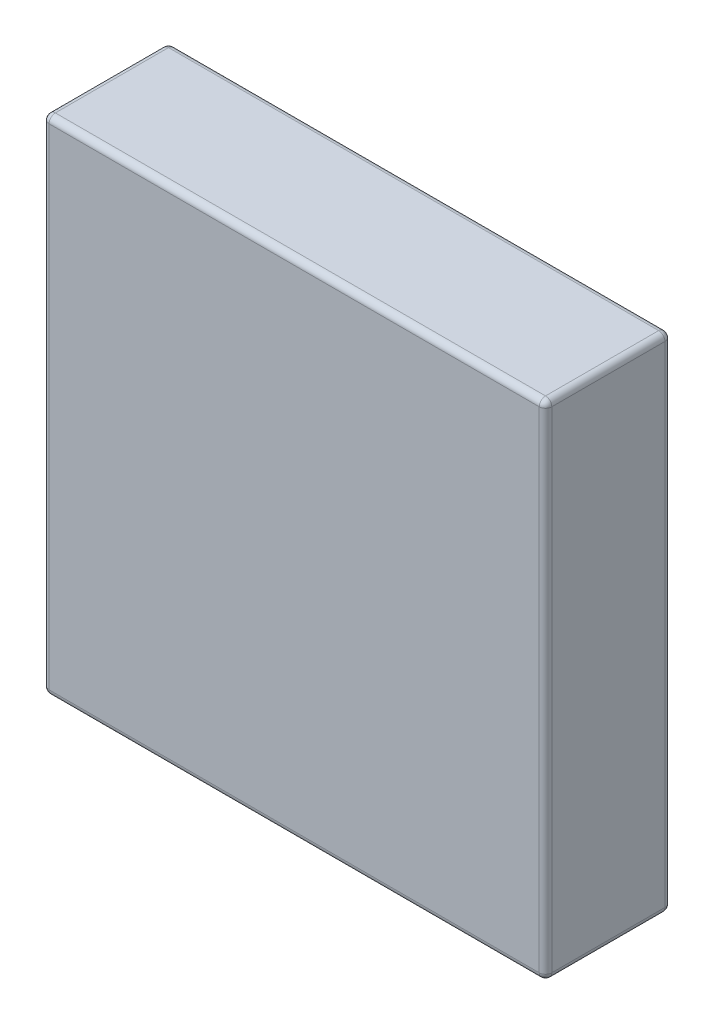
ISO-10303-21;
HEADER;
FILE_DESCRIPTION(('STEP AP214'),'2;1');
FILE_NAME('part.step','',(''),(''),'','','');
FILE_SCHEMA(('AUTOMOTIVE_DESIGN { 1 0 10303 214 1 1 1 1 }'));
ENDSEC;
DATA;
#1=APPLICATION_CONTEXT('core data for automotive mechanical design processes');
#2=APPLICATION_PROTOCOL_DEFINITION('international standard','automotive_design',2000,#1);
#3=PRODUCT_CONTEXT('',#1,'mechanical');
#4=PRODUCT('Part','Part','',(#3));
#5=PRODUCT_RELATED_PRODUCT_CATEGORY('part','',(#4));
#6=PRODUCT_DEFINITION_FORMATION('','',#4);
#7=PRODUCT_DEFINITION_CONTEXT('part definition',#1,'design');
#8=PRODUCT_DEFINITION('design','',#6,#7);
#9=PRODUCT_DEFINITION_SHAPE('','',#8);
#10=(LENGTH_UNIT() NAMED_UNIT(*) SI_UNIT(.MILLI.,.METRE.));
#11=(NAMED_UNIT(*) PLANE_ANGLE_UNIT() SI_UNIT($,.RADIAN.));
#12=(NAMED_UNIT(*) SI_UNIT($,.STERADIAN.) SOLID_ANGLE_UNIT());
#13=UNCERTAINTY_MEASURE_WITH_UNIT(LENGTH_MEASURE(1.E-05),#10,'distance_accuracy_value','');
#14=(GEOMETRIC_REPRESENTATION_CONTEXT(3) GLOBAL_UNCERTAINTY_ASSIGNED_CONTEXT((#13)) GLOBAL_UNIT_ASSIGNED_CONTEXT((#10,
#11,#12)) REPRESENTATION_CONTEXT('',''));
#15=CARTESIAN_POINT('',(0.,0.,0.));
#16=DIRECTION('',(0.,0.,1.));
#17=DIRECTION('',(1.,0.,0.));
#18=AXIS2_PLACEMENT_3D('',#15,#16,#17);
#19=CARTESIAN_POINT('',(0.,0.,10.));
#20=DIRECTION('',(1.,0.,0.));
#21=DIRECTION('',(0.,0.,-1.));
#22=AXIS2_PLACEMENT_3D('',#19,#20,#21);
#23=PLANE('',#22);
#24=DIRECTION('',(0.,-1.,0.));
#25=VECTOR('',#24,1.);
#26=CARTESIAN_POINT('',(0.,0.,0.5));
#27=LINE('',#26,#25);
#28=CARTESIAN_POINT('',(0.,39.5,0.5));
#29=VERTEX_POINT('',#28);
#30=CARTESIAN_POINT('',(0.,0.5,0.5));
#31=VERTEX_POINT('',#30);
#32=EDGE_CURVE('E277',#29,#31,#27,.T.);
#33=ORIENTED_EDGE('',*,*,#32,.T.);
#34=DIRECTION('',(0.,0.,-1.));
#35=VECTOR('',#34,1.);
#36=CARTESIAN_POINT('',(0.,0.5,10.));
#37=LINE('',#36,#35);
#38=CARTESIAN_POINT('',(0.,0.5,9.5));
#39=VERTEX_POINT('',#38);
#40=EDGE_CURVE('E221',#31,#39,#37,.F.);
#41=ORIENTED_EDGE('',*,*,#40,.T.);
#42=DIRECTION('',(0.,-1.,0.));
#43=VECTOR('',#42,1.);
#44=CARTESIAN_POINT('',(0.,0.,9.5));
#45=LINE('',#44,#43);
#46=CARTESIAN_POINT('',(0.,39.5,9.5));
#47=VERTEX_POINT('',#46);
#48=EDGE_CURVE('E226',#39,#47,#45,.F.);
#49=ORIENTED_EDGE('',*,*,#48,.T.);
#50=DIRECTION('',(0.,0.,-1.));
#51=VECTOR('',#50,1.);
#52=CARTESIAN_POINT('',(0.,39.5,10.));
#53=LINE('',#52,#51);
#54=EDGE_CURVE('E309',#47,#29,#53,.T.);
#55=ORIENTED_EDGE('',*,*,#54,.T.);
#56=EDGE_LOOP('',(#33,#41,#49,#55));
#57=FACE_BOUND('',#56,.T.);
#58=ADVANCED_FACE('F35',(#57),#23,.F.);
#59=CARTESIAN_POINT('',(0.,0.,10.));
#60=DIRECTION('',(0.,1.,0.));
#61=DIRECTION('',(0.,0.,1.));
#62=AXIS2_PLACEMENT_3D('',#59,#60,#61);
#63=PLANE('',#62);
#64=DIRECTION('',(1.,0.,0.));
#65=VECTOR('',#64,1.);
#66=CARTESIAN_POINT('',(0.,0.,9.5));
#67=LINE('',#66,#65);
#68=CARTESIAN_POINT('',(39.5,0.,9.5));
#69=VERTEX_POINT('',#68);
#70=CARTESIAN_POINT('',(0.5,0.,9.5));
#71=VERTEX_POINT('',#70);
#72=EDGE_CURVE('E133',#69,#71,#67,.F.);
#73=ORIENTED_EDGE('',*,*,#72,.T.);
#74=DIRECTION('',(0.,0.,-1.));
#75=VECTOR('',#74,1.);
#76=CARTESIAN_POINT('',(0.5,0.,10.));
#77=LINE('',#76,#75);
#78=CARTESIAN_POINT('',(0.5,0.,0.5));
#79=VERTEX_POINT('',#78);
#80=EDGE_CURVE('E129',#71,#79,#77,.T.);
#81=ORIENTED_EDGE('',*,*,#80,.T.);
#82=DIRECTION('',(1.,0.,0.));
#83=VECTOR('',#82,1.);
#84=CARTESIAN_POINT('',(40.,0.,0.5));
#85=LINE('',#84,#83);
#86=CARTESIAN_POINT('',(39.5,0.,0.5));
#87=VERTEX_POINT('',#86);
#88=EDGE_CURVE('E123',#79,#87,#85,.T.);
#89=ORIENTED_EDGE('',*,*,#88,.T.);
#90=DIRECTION('',(0.,0.,-1.));
#91=VECTOR('',#90,1.);
#92=CARTESIAN_POINT('',(39.5,0.,10.));
#93=LINE('',#92,#91);
#94=EDGE_CURVE('E126',#87,#69,#93,.F.);
#95=ORIENTED_EDGE('',*,*,#94,.T.);
#96=EDGE_LOOP('',(#73,#81,#89,#95));
#97=FACE_BOUND('',#96,.T.);
#98=ADVANCED_FACE('F125',(#97),#63,.F.);
#99=CARTESIAN_POINT('',(40.,0.,10.));
#100=DIRECTION('',(-1.,0.,0.));
#101=DIRECTION('',(0.,0.,1.));
#102=AXIS2_PLACEMENT_3D('',#99,#100,#101);
#103=PLANE('',#102);
#104=DIRECTION('',(0.,1.,0.));
#105=VECTOR('',#104,1.);
#106=CARTESIAN_POINT('',(40.,0.,9.5));
#107=LINE('',#106,#105);
#108=CARTESIAN_POINT('',(40.,39.5,9.5));
#109=VERTEX_POINT('',#108);
#110=CARTESIAN_POINT('',(40.,0.5,9.5));
#111=VERTEX_POINT('',#110);
#112=EDGE_CURVE('E245',#109,#111,#107,.F.);
#113=ORIENTED_EDGE('',*,*,#112,.T.);
#114=DIRECTION('',(0.,0.,-1.));
#115=VECTOR('',#114,1.);
#116=CARTESIAN_POINT('',(40.,0.5,10.));
#117=LINE('',#116,#115);
#118=CARTESIAN_POINT('',(40.,0.5,0.5));
#119=VERTEX_POINT('',#118);
#120=EDGE_CURVE('E247',#111,#119,#117,.T.);
#121=ORIENTED_EDGE('',*,*,#120,.T.);
#122=DIRECTION('',(0.,1.,0.));
#123=VECTOR('',#122,1.);
#124=CARTESIAN_POINT('',(40.,40.,0.5));
#125=LINE('',#124,#123);
#126=CARTESIAN_POINT('',(40.,39.5,0.5));
#127=VERTEX_POINT('',#126);
#128=EDGE_CURVE('E243',#119,#127,#125,.T.);
#129=ORIENTED_EDGE('',*,*,#128,.T.);
#130=DIRECTION('',(0.,0.,-1.));
#131=VECTOR('',#130,1.);
#132=CARTESIAN_POINT('',(40.,39.5,10.));
#133=LINE('',#132,#131);
#134=EDGE_CURVE('E241',#127,#109,#133,.F.);
#135=ORIENTED_EDGE('',*,*,#134,.T.);
#136=EDGE_LOOP('',(#113,#121,#129,#135));
#137=FACE_BOUND('',#136,.T.);
#138=ADVANCED_FACE('F297',(#137),#103,.F.);
#139=CARTESIAN_POINT('',(0.,40.,10.));
#140=DIRECTION('',(0.,-1.,0.));
#141=DIRECTION('',(0.,0.,-1.));
#142=AXIS2_PLACEMENT_3D('',#139,#140,#141);
#143=PLANE('',#142);
#144=DIRECTION('',(-1.,0.,0.));
#145=VECTOR('',#144,1.);
#146=CARTESIAN_POINT('',(0.,40.,9.5));
#147=LINE('',#146,#145);
#148=CARTESIAN_POINT('',(0.5,40.,9.5));
#149=VERTEX_POINT('',#148);
#150=CARTESIAN_POINT('',(39.5,40.,9.5));
#151=VERTEX_POINT('',#150);
#152=EDGE_CURVE('E44',#149,#151,#147,.F.);
#153=ORIENTED_EDGE('',*,*,#152,.T.);
#154=DIRECTION('',(0.,0.,-1.));
#155=VECTOR('',#154,1.);
#156=CARTESIAN_POINT('',(39.5,40.,10.));
#157=LINE('',#156,#155);
#158=CARTESIAN_POINT('',(39.5,40.,0.5));
#159=VERTEX_POINT('',#158);
#160=EDGE_CURVE('E11',#151,#159,#157,.T.);
#161=ORIENTED_EDGE('',*,*,#160,.T.);
#162=DIRECTION('',(-1.,0.,0.));
#163=VECTOR('',#162,1.);
#164=CARTESIAN_POINT('',(0.,40.,0.5));
#165=LINE('',#164,#163);
#166=CARTESIAN_POINT('',(0.5,40.,0.5));
#167=VERTEX_POINT('',#166);
#168=EDGE_CURVE('E250',#159,#167,#165,.T.);
#169=ORIENTED_EDGE('',*,*,#168,.T.);
#170=DIRECTION('',(0.,0.,-1.));
#171=VECTOR('',#170,1.);
#172=CARTESIAN_POINT('',(0.5,40.,10.));
#173=LINE('',#172,#171);
#174=EDGE_CURVE('E55',#167,#149,#173,.F.);
#175=ORIENTED_EDGE('',*,*,#174,.T.);
#176=EDGE_LOOP('',(#153,#161,#169,#175));
#177=FACE_BOUND('',#176,.T.);
#178=ADVANCED_FACE('F501',(#177),#143,.F.);
#179=CARTESIAN_POINT('',(0.,0.,10.));
#180=DIRECTION('',(0.,0.,-1.));
#181=DIRECTION('',(-1.,0.,0.));
#182=AXIS2_PLACEMENT_3D('',#179,#180,#181);
#183=PLANE('',#182);
#184=DIRECTION('',(0.,-1.,0.));
#185=VECTOR('',#184,1.);
#186=CARTESIAN_POINT('',(0.5,0.,10.));
#187=LINE('',#186,#185);
#188=CARTESIAN_POINT('',(0.5,39.5,10.));
#189=VERTEX_POINT('',#188);
#190=CARTESIAN_POINT('',(0.5,0.5,10.));
#191=VERTEX_POINT('',#190);
#192=EDGE_CURVE('E223',#189,#191,#187,.T.);
#193=ORIENTED_EDGE('',*,*,#192,.T.);
#194=DIRECTION('',(1.,0.,0.));
#195=VECTOR('',#194,1.);
#196=CARTESIAN_POINT('',(0.,0.5,10.));
#197=LINE('',#196,#195);
#198=CARTESIAN_POINT('',(39.5,0.5,10.));
#199=VERTEX_POINT('',#198);
#200=EDGE_CURVE('E231',#191,#199,#197,.T.);
#201=ORIENTED_EDGE('',*,*,#200,.T.);
#202=DIRECTION('',(0.,1.,0.));
#203=VECTOR('',#202,1.);
#204=CARTESIAN_POINT('',(39.5,0.,10.));
#205=LINE('',#204,#203);
#206=CARTESIAN_POINT('',(39.5,39.5,10.));
#207=VERTEX_POINT('',#206);
#208=EDGE_CURVE('E220',#199,#207,#205,.T.);
#209=ORIENTED_EDGE('',*,*,#208,.T.);
#210=DIRECTION('',(-1.,0.,0.));
#211=VECTOR('',#210,1.);
#212=CARTESIAN_POINT('',(0.,39.5,10.));
#213=LINE('',#212,#211);
#214=EDGE_CURVE('E217',#207,#189,#213,.T.);
#215=ORIENTED_EDGE('',*,*,#214,.T.);
#216=EDGE_LOOP('',(#193,#201,#209,#215));
#217=FACE_BOUND('',#216,.T.);
#218=ADVANCED_FACE('F493',(#217),#183,.F.);
#219=CARTESIAN_POINT('',(0.,0.,0.));
#220=DIRECTION('',(0.,0.,-1.));
#221=DIRECTION('',(-1.,0.,0.));
#222=AXIS2_PLACEMENT_3D('',#219,#220,#221);
#223=PLANE('',#222);
#224=DIRECTION('',(0.,1.,0.));
#225=VECTOR('',#224,1.);
#226=CARTESIAN_POINT('',(39.5,0.,0.));
#227=LINE('',#226,#225);
#228=CARTESIAN_POINT('',(39.5,39.5,0.));
#229=VERTEX_POINT('',#228);
#230=CARTESIAN_POINT('',(39.5,0.5,0.));
#231=VERTEX_POINT('',#230);
#232=EDGE_CURVE('E236',#229,#231,#227,.F.);
#233=ORIENTED_EDGE('',*,*,#232,.T.);
#234=DIRECTION('',(1.,0.,0.));
#235=VECTOR('',#234,1.);
#236=CARTESIAN_POINT('',(0.,0.5,0.));
#237=LINE('',#236,#235);
#238=CARTESIAN_POINT('',(0.5,0.5,0.));
#239=VERTEX_POINT('',#238);
#240=EDGE_CURVE('E156',#231,#239,#237,.F.);
#241=ORIENTED_EDGE('',*,*,#240,.T.);
#242=DIRECTION('',(0.,-1.,0.));
#243=VECTOR('',#242,1.);
#244=CARTESIAN_POINT('',(0.5,40.,0.));
#245=LINE('',#244,#243);
#246=CARTESIAN_POINT('',(0.5,39.5,0.));
#247=VERTEX_POINT('',#246);
#248=EDGE_CURVE('E238',#239,#247,#245,.F.);
#249=ORIENTED_EDGE('',*,*,#248,.T.);
#250=DIRECTION('',(-1.,0.,0.));
#251=VECTOR('',#250,1.);
#252=CARTESIAN_POINT('',(40.,39.5,0.));
#253=LINE('',#252,#251);
#254=EDGE_CURVE('E234',#247,#229,#253,.F.);
#255=ORIENTED_EDGE('',*,*,#254,.T.);
#256=EDGE_LOOP('',(#233,#241,#249,#255));
#257=FACE_BOUND('',#256,.T.);
#258=ADVANCED_FACE('F292',(#257),#223,.T.);
#259=CARTESIAN_POINT('',(39.5,39.5,10.));
#260=DIRECTION('',(0.,0.,-1.));
#261=DIRECTION('',(-1.,0.,0.));
#262=AXIS2_PLACEMENT_3D('',#259,#260,#261);
#263=CYLINDRICAL_SURFACE('',#262,0.5);
#264=CARTESIAN_POINT('',(39.5,39.5,9.5));
#265=DIRECTION('',(0.,0.,1.));
#266=DIRECTION('',(1.,0.,0.));
#267=AXIS2_PLACEMENT_3D('',#264,#265,#266);
#268=CIRCLE('',#267,0.5);
#269=EDGE_CURVE('E39',#109,#151,#268,.T.);
#270=ORIENTED_EDGE('',*,*,#269,.F.);
#271=ORIENTED_EDGE('',*,*,#134,.F.);
#272=CARTESIAN_POINT('',(39.5,39.5,0.5));
#273=DIRECTION('',(0.,0.,-1.));
#274=DIRECTION('',(-1.,0.,0.));
#275=AXIS2_PLACEMENT_3D('',#272,#273,#274);
#276=CIRCLE('',#275,0.5);
#277=EDGE_CURVE('E197',#159,#127,#276,.T.);
#278=ORIENTED_EDGE('',*,*,#277,.F.);
#279=ORIENTED_EDGE('',*,*,#160,.F.);
#280=EDGE_LOOP('',(#270,#271,#278,#279));
#281=FACE_BOUND('',#280,.T.);
#282=ADVANCED_FACE('F37',(#281),#263,.T.);
#283=CARTESIAN_POINT('',(39.5,39.5,9.5));
#284=DIRECTION('',(0.,0.,1.));
#285=DIRECTION('',(1.,0.,0.));
#286=AXIS2_PLACEMENT_3D('',#283,#284,#285);
#287=SPHERICAL_SURFACE('',#286,0.5);
#288=CARTESIAN_POINT('',(39.5,39.5,9.5));
#289=DIRECTION('',(0.,1.,0.));
#290=DIRECTION('',(0.,0.,1.));
#291=AXIS2_PLACEMENT_3D('',#288,#289,#290);
#292=CIRCLE('',#291,0.5);
#293=EDGE_CURVE('E192',#109,#207,#292,.F.);
#294=ORIENTED_EDGE('',*,*,#293,.F.);
#295=ORIENTED_EDGE('',*,*,#269,.T.);
#296=CARTESIAN_POINT('',(39.5,39.5,9.5));
#297=DIRECTION('',(1.,0.,0.));
#298=DIRECTION('',(0.,0.,-1.));
#299=AXIS2_PLACEMENT_3D('',#296,#297,#298);
#300=CIRCLE('',#299,0.5);
#301=EDGE_CURVE('E195',#207,#151,#300,.F.);
#302=ORIENTED_EDGE('',*,*,#301,.F.);
#303=EDGE_LOOP('',(#294,#295,#302));
#304=FACE_BOUND('',#303,.T.);
#305=ADVANCED_FACE('F208',(#304),#287,.T.);
#306=CARTESIAN_POINT('',(39.5,39.5,0.5));
#307=DIRECTION('',(0.,0.,1.));
#308=DIRECTION('',(1.,0.,0.));
#309=AXIS2_PLACEMENT_3D('',#306,#307,#308);
#310=SPHERICAL_SURFACE('',#309,0.5);
#311=CARTESIAN_POINT('',(39.5,39.5,0.5));
#312=DIRECTION('',(1.,0.,0.));
#313=DIRECTION('',(0.,0.,-1.));
#314=AXIS2_PLACEMENT_3D('',#311,#312,#313);
#315=CIRCLE('',#314,0.5);
#316=EDGE_CURVE('E186',#159,#229,#315,.F.);
#317=ORIENTED_EDGE('',*,*,#316,.F.);
#318=ORIENTED_EDGE('',*,*,#277,.T.);
#319=CARTESIAN_POINT('',(39.5,39.5,0.5));
#320=DIRECTION('',(0.,1.,0.));
#321=DIRECTION('',(0.,0.,1.));
#322=AXIS2_PLACEMENT_3D('',#319,#320,#321);
#323=CIRCLE('',#322,0.5);
#324=EDGE_CURVE('E189',#229,#127,#323,.F.);
#325=ORIENTED_EDGE('',*,*,#324,.F.);
#326=EDGE_LOOP('',(#317,#318,#325));
#327=FACE_BOUND('',#326,.T.);
#328=ADVANCED_FACE('F321',(#327),#310,.T.);
#329=CARTESIAN_POINT('',(0.,39.5,9.5));
#330=DIRECTION('',(-1.,0.,0.));
#331=DIRECTION('',(0.,0.,1.));
#332=AXIS2_PLACEMENT_3D('',#329,#330,#331);
#333=CYLINDRICAL_SURFACE('',#332,0.5);
#334=ORIENTED_EDGE('',*,*,#301,.T.);
#335=ORIENTED_EDGE('',*,*,#152,.F.);
#336=CARTESIAN_POINT('',(0.5,39.5,9.5));
#337=DIRECTION('',(-1.,0.,0.));
#338=DIRECTION('',(0.,0.,1.));
#339=AXIS2_PLACEMENT_3D('',#336,#337,#338);
#340=CIRCLE('',#339,0.5);
#341=EDGE_CURVE('E180',#189,#149,#340,.T.);
#342=ORIENTED_EDGE('',*,*,#341,.F.);
#343=ORIENTED_EDGE('',*,*,#214,.F.);
#344=EDGE_LOOP('',(#334,#335,#342,#343));
#345=FACE_BOUND('',#344,.T.);
#346=ADVANCED_FACE('F214',(#345),#333,.T.);
#347=CARTESIAN_POINT('',(39.5,0.,9.5));
#348=DIRECTION('',(0.,1.,0.));
#349=DIRECTION('',(0.,0.,1.));
#350=AXIS2_PLACEMENT_3D('',#347,#348,#349);
#351=CYLINDRICAL_SURFACE('',#350,0.5);
#352=ORIENTED_EDGE('',*,*,#293,.T.);
#353=ORIENTED_EDGE('',*,*,#208,.F.);
#354=CARTESIAN_POINT('',(39.5,0.5,9.5));
#355=DIRECTION('',(0.,-1.,0.));
#356=DIRECTION('',(0.,0.,-1.));
#357=AXIS2_PLACEMENT_3D('',#354,#355,#356);
#358=CIRCLE('',#357,0.5);
#359=EDGE_CURVE('E177',#111,#199,#358,.T.);
#360=ORIENTED_EDGE('',*,*,#359,.F.);
#361=ORIENTED_EDGE('',*,*,#112,.F.);
#362=EDGE_LOOP('',(#352,#353,#360,#361));
#363=FACE_BOUND('',#362,.T.);
#364=ADVANCED_FACE('F301',(#363),#351,.T.);
#365=CARTESIAN_POINT('',(39.5,0.5,10.));
#366=DIRECTION('',(0.,0.,-1.));
#367=DIRECTION('',(-1.,0.,0.));
#368=AXIS2_PLACEMENT_3D('',#365,#366,#367);
#369=CYLINDRICAL_SURFACE('',#368,0.5);
#370=CARTESIAN_POINT('',(39.5,0.5,0.5));
#371=DIRECTION('',(0.,0.,-1.));
#372=DIRECTION('',(-1.,0.,0.));
#373=AXIS2_PLACEMENT_3D('',#370,#371,#372);
#374=CIRCLE('',#373,0.5);
#375=EDGE_CURVE('E140',#119,#87,#374,.T.);
#376=ORIENTED_EDGE('',*,*,#375,.F.);
#377=ORIENTED_EDGE('',*,*,#120,.F.);
#378=CARTESIAN_POINT('',(39.5,0.5,9.5));
#379=DIRECTION('',(0.,0.,1.));
#380=DIRECTION('',(1.,0.,0.));
#381=AXIS2_PLACEMENT_3D('',#378,#379,#380);
#382=CIRCLE('',#381,0.5);
#383=EDGE_CURVE('E143',#69,#111,#382,.T.);
#384=ORIENTED_EDGE('',*,*,#383,.F.);
#385=ORIENTED_EDGE('',*,*,#94,.F.);
#386=EDGE_LOOP('',(#376,#377,#384,#385));
#387=FACE_BOUND('',#386,.T.);
#388=ADVANCED_FACE('F138',(#387),#369,.T.);
#389=CARTESIAN_POINT('',(39.5,0.,0.5));
#390=DIRECTION('',(0.,-1.,0.));
#391=DIRECTION('',(0.,0.,-1.));
#392=AXIS2_PLACEMENT_3D('',#389,#390,#391);
#393=CYLINDRICAL_SURFACE('',#392,0.5);
#394=ORIENTED_EDGE('',*,*,#324,.T.);
#395=ORIENTED_EDGE('',*,*,#128,.F.);
#396=CARTESIAN_POINT('',(39.5,0.5,0.5));
#397=DIRECTION('',(0.,-1.,0.));
#398=DIRECTION('',(0.,0.,-1.));
#399=AXIS2_PLACEMENT_3D('',#396,#397,#398);
#400=CIRCLE('',#399,0.5);
#401=EDGE_CURVE('E152',#231,#119,#400,.T.);
#402=ORIENTED_EDGE('',*,*,#401,.F.);
#403=ORIENTED_EDGE('',*,*,#232,.F.);
#404=EDGE_LOOP('',(#394,#395,#402,#403));
#405=FACE_BOUND('',#404,.T.);
#406=ADVANCED_FACE('F295',(#405),#393,.T.);
#407=CARTESIAN_POINT('',(0.,39.5,0.5));
#408=DIRECTION('',(1.,0.,0.));
#409=DIRECTION('',(0.,0.,-1.));
#410=AXIS2_PLACEMENT_3D('',#407,#408,#409);
#411=CYLINDRICAL_SURFACE('',#410,0.5);
#412=ORIENTED_EDGE('',*,*,#316,.T.);
#413=ORIENTED_EDGE('',*,*,#254,.F.);
#414=CARTESIAN_POINT('',(0.5,39.5,0.5));
#415=DIRECTION('',(-1.,0.,0.));
#416=DIRECTION('',(0.,0.,1.));
#417=AXIS2_PLACEMENT_3D('',#414,#415,#416);
#418=CIRCLE('',#417,0.5);
#419=EDGE_CURVE('E172',#167,#247,#418,.T.);
#420=ORIENTED_EDGE('',*,*,#419,.F.);
#421=ORIENTED_EDGE('',*,*,#168,.F.);
#422=EDGE_LOOP('',(#412,#413,#420,#421));
#423=FACE_BOUND('',#422,.T.);
#424=ADVANCED_FACE('F320',(#423),#411,.T.);
#425=CARTESIAN_POINT('',(0.5,39.5,10.));
#426=DIRECTION('',(0.,0.,-1.));
#427=DIRECTION('',(-1.,0.,0.));
#428=AXIS2_PLACEMENT_3D('',#425,#426,#427);
#429=CYLINDRICAL_SURFACE('',#428,0.5);
#430=CARTESIAN_POINT('',(0.5,39.5,9.5));
#431=DIRECTION('',(0.,0.,1.));
#432=DIRECTION('',(1.,0.,0.));
#433=AXIS2_PLACEMENT_3D('',#430,#431,#432);
#434=CIRCLE('',#433,0.5);
#435=EDGE_CURVE('E183',#149,#47,#434,.T.);
#436=ORIENTED_EDGE('',*,*,#435,.F.);
#437=ORIENTED_EDGE('',*,*,#174,.F.);
#438=CARTESIAN_POINT('',(0.5,39.5,0.5));
#439=DIRECTION('',(0.,0.,-1.));
#440=DIRECTION('',(-1.,0.,0.));
#441=AXIS2_PLACEMENT_3D('',#438,#439,#440);
#442=CIRCLE('',#441,0.5);
#443=EDGE_CURVE('E169',#29,#167,#442,.T.);
#444=ORIENTED_EDGE('',*,*,#443,.F.);
#445=ORIENTED_EDGE('',*,*,#54,.F.);
#446=EDGE_LOOP('',(#436,#437,#444,#445));
#447=FACE_BOUND('',#446,.T.);
#448=ADVANCED_FACE('F315',(#447),#429,.T.);
#449=CARTESIAN_POINT('',(0.5,39.5,9.5));
#450=DIRECTION('',(0.,0.,1.));
#451=DIRECTION('',(1.,0.,0.));
#452=AXIS2_PLACEMENT_3D('',#449,#450,#451);
#453=SPHERICAL_SURFACE('',#452,0.5);
#454=ORIENTED_EDGE('',*,*,#341,.T.);
#455=ORIENTED_EDGE('',*,*,#435,.T.);
#456=CARTESIAN_POINT('',(0.5,39.5,9.5));
#457=DIRECTION('',(0.,1.,0.));
#458=DIRECTION('',(0.,0.,1.));
#459=AXIS2_PLACEMENT_3D('',#456,#457,#458);
#460=CIRCLE('',#459,0.5);
#461=EDGE_CURVE('E160',#189,#47,#460,.F.);
#462=ORIENTED_EDGE('',*,*,#461,.F.);
#463=EDGE_LOOP('',(#454,#455,#462));
#464=FACE_BOUND('',#463,.T.);
#465=ADVANCED_FACE('F357',(#464),#453,.T.);
#466=CARTESIAN_POINT('',(39.5,0.5,9.5));
#467=DIRECTION('',(0.,0.,1.));
#468=DIRECTION('',(1.,0.,0.));
#469=AXIS2_PLACEMENT_3D('',#466,#467,#468);
#470=SPHERICAL_SURFACE('',#469,0.5);
#471=ORIENTED_EDGE('',*,*,#383,.T.);
#472=ORIENTED_EDGE('',*,*,#359,.T.);
#473=CARTESIAN_POINT('',(39.5,0.5,9.5));
#474=DIRECTION('',(1.,0.,0.));
#475=DIRECTION('',(0.,0.,-1.));
#476=AXIS2_PLACEMENT_3D('',#473,#474,#475);
#477=CIRCLE('',#476,0.5);
#478=EDGE_CURVE('E157',#69,#199,#477,.F.);
#479=ORIENTED_EDGE('',*,*,#478,.F.);
#480=EDGE_LOOP('',(#471,#472,#479));
#481=FACE_BOUND('',#480,.T.);
#482=ADVANCED_FACE('F303',(#481),#470,.T.);
#483=CARTESIAN_POINT('',(39.5,0.5,0.5));
#484=DIRECTION('',(0.,0.,1.));
#485=DIRECTION('',(1.,0.,0.));
#486=AXIS2_PLACEMENT_3D('',#483,#484,#485);
#487=SPHERICAL_SURFACE('',#486,0.5);
#488=ORIENTED_EDGE('',*,*,#401,.T.);
#489=ORIENTED_EDGE('',*,*,#375,.T.);
#490=CARTESIAN_POINT('',(39.5,0.5,0.5));
#491=DIRECTION('',(1.,0.,0.));
#492=DIRECTION('',(0.,0.,-1.));
#493=AXIS2_PLACEMENT_3D('',#490,#491,#492);
#494=CIRCLE('',#493,0.5);
#495=EDGE_CURVE('E149',#231,#87,#494,.F.);
#496=ORIENTED_EDGE('',*,*,#495,.F.);
#497=EDGE_LOOP('',(#488,#489,#496));
#498=FACE_BOUND('',#497,.T.);
#499=ADVANCED_FACE('F148',(#498),#487,.T.);
#500=CARTESIAN_POINT('',(0.5,39.5,0.5));
#501=DIRECTION('',(0.,0.,1.));
#502=DIRECTION('',(1.,0.,0.));
#503=AXIS2_PLACEMENT_3D('',#500,#501,#502);
#504=SPHERICAL_SURFACE('',#503,0.5);
#505=ORIENTED_EDGE('',*,*,#443,.T.);
#506=ORIENTED_EDGE('',*,*,#419,.T.);
#507=CARTESIAN_POINT('',(0.5,39.5,0.5));
#508=DIRECTION('',(0.,1.,0.));
#509=DIRECTION('',(0.,0.,1.));
#510=AXIS2_PLACEMENT_3D('',#507,#508,#509);
#511=CIRCLE('',#510,0.5);
#512=EDGE_CURVE('E158',#29,#247,#511,.F.);
#513=ORIENTED_EDGE('',*,*,#512,.F.);
#514=EDGE_LOOP('',(#505,#506,#513));
#515=FACE_BOUND('',#514,.T.);
#516=ADVANCED_FACE('F318',(#515),#504,.T.);
#517=CARTESIAN_POINT('',(0.5,0.,9.5));
#518=DIRECTION('',(0.,-1.,0.));
#519=DIRECTION('',(0.,0.,-1.));
#520=AXIS2_PLACEMENT_3D('',#517,#518,#519);
#521=CYLINDRICAL_SURFACE('',#520,0.5);
#522=ORIENTED_EDGE('',*,*,#461,.T.);
#523=ORIENTED_EDGE('',*,*,#48,.F.);
#524=CARTESIAN_POINT('',(0.5,0.5,9.5));
#525=DIRECTION('',(0.,-1.,0.));
#526=DIRECTION('',(0.,0.,-1.));
#527=AXIS2_PLACEMENT_3D('',#524,#525,#526);
#528=CIRCLE('',#527,0.5);
#529=EDGE_CURVE('E163',#191,#39,#528,.T.);
#530=ORIENTED_EDGE('',*,*,#529,.F.);
#531=ORIENTED_EDGE('',*,*,#192,.F.);
#532=EDGE_LOOP('',(#522,#523,#530,#531));
#533=FACE_BOUND('',#532,.T.);
#534=ADVANCED_FACE('F274',(#533),#521,.T.);
#535=CARTESIAN_POINT('',(0.,0.5,9.5));
#536=DIRECTION('',(1.,0.,0.));
#537=DIRECTION('',(0.,0.,-1.));
#538=AXIS2_PLACEMENT_3D('',#535,#536,#537);
#539=CYLINDRICAL_SURFACE('',#538,0.5);
#540=ORIENTED_EDGE('',*,*,#478,.T.);
#541=ORIENTED_EDGE('',*,*,#200,.F.);
#542=CARTESIAN_POINT('',(0.5,0.5,9.5));
#543=DIRECTION('',(-1.,0.,0.));
#544=DIRECTION('',(0.,0.,1.));
#545=AXIS2_PLACEMENT_3D('',#542,#543,#544);
#546=CIRCLE('',#545,0.5);
#547=EDGE_CURVE('E263',#71,#191,#546,.T.);
#548=ORIENTED_EDGE('',*,*,#547,.F.);
#549=ORIENTED_EDGE('',*,*,#72,.F.);
#550=EDGE_LOOP('',(#540,#541,#548,#549));
#551=FACE_BOUND('',#550,.T.);
#552=ADVANCED_FACE('F307',(#551),#539,.T.);
#553=CARTESIAN_POINT('',(0.,0.5,0.5));
#554=DIRECTION('',(-1.,0.,0.));
#555=DIRECTION('',(0.,0.,1.));
#556=AXIS2_PLACEMENT_3D('',#553,#554,#555);
#557=CYLINDRICAL_SURFACE('',#556,0.5);
#558=ORIENTED_EDGE('',*,*,#495,.T.);
#559=ORIENTED_EDGE('',*,*,#88,.F.);
#560=CARTESIAN_POINT('',(0.5,0.5,0.5));
#561=DIRECTION('',(-1.,0.,0.));
#562=DIRECTION('',(0.,0.,1.));
#563=AXIS2_PLACEMENT_3D('',#560,#561,#562);
#564=CIRCLE('',#563,0.5);
#565=EDGE_CURVE('E260',#239,#79,#564,.T.);
#566=ORIENTED_EDGE('',*,*,#565,.F.);
#567=ORIENTED_EDGE('',*,*,#240,.F.);
#568=EDGE_LOOP('',(#558,#559,#566,#567));
#569=FACE_BOUND('',#568,.T.);
#570=ADVANCED_FACE('F154',(#569),#557,.T.);
#571=CARTESIAN_POINT('',(0.5,0.,0.5));
#572=DIRECTION('',(0.,1.,0.));
#573=DIRECTION('',(0.,0.,1.));
#574=AXIS2_PLACEMENT_3D('',#571,#572,#573);
#575=CYLINDRICAL_SURFACE('',#574,0.5);
#576=ORIENTED_EDGE('',*,*,#512,.T.);
#577=ORIENTED_EDGE('',*,*,#248,.F.);
#578=CARTESIAN_POINT('',(0.5,0.5,0.5));
#579=DIRECTION('',(0.,-1.,0.));
#580=DIRECTION('',(0.,0.,-1.));
#581=AXIS2_PLACEMENT_3D('',#578,#579,#580);
#582=CIRCLE('',#581,0.5);
#583=EDGE_CURVE('E258',#31,#239,#582,.T.);
#584=ORIENTED_EDGE('',*,*,#583,.F.);
#585=ORIENTED_EDGE('',*,*,#32,.F.);
#586=EDGE_LOOP('',(#576,#577,#584,#585));
#587=FACE_BOUND('',#586,.T.);
#588=ADVANCED_FACE('F288',(#587),#575,.T.);
#589=CARTESIAN_POINT('',(0.5,0.5,9.5));
#590=DIRECTION('',(0.,0.,1.));
#591=DIRECTION('',(1.,0.,0.));
#592=AXIS2_PLACEMENT_3D('',#589,#590,#591);
#593=SPHERICAL_SURFACE('',#592,0.5);
#594=ORIENTED_EDGE('',*,*,#547,.T.);
#595=ORIENTED_EDGE('',*,*,#529,.T.);
#596=CARTESIAN_POINT('',(0.5,0.5,9.5));
#597=DIRECTION('',(0.,0.,1.));
#598=DIRECTION('',(1.,0.,0.));
#599=AXIS2_PLACEMENT_3D('',#596,#597,#598);
#600=CIRCLE('',#599,0.5);
#601=EDGE_CURVE('E256',#71,#39,#600,.F.);
#602=ORIENTED_EDGE('',*,*,#601,.F.);
#603=EDGE_LOOP('',(#594,#595,#602));
#604=FACE_BOUND('',#603,.T.);
#605=ADVANCED_FACE('F270',(#604),#593,.T.);
#606=CARTESIAN_POINT('',(0.5,0.5,0.5));
#607=DIRECTION('',(0.,0.,1.));
#608=DIRECTION('',(1.,0.,0.));
#609=AXIS2_PLACEMENT_3D('',#606,#607,#608);
#610=SPHERICAL_SURFACE('',#609,0.5);
#611=ORIENTED_EDGE('',*,*,#583,.T.);
#612=ORIENTED_EDGE('',*,*,#565,.T.);
#613=CARTESIAN_POINT('',(0.5,0.5,0.5));
#614=DIRECTION('',(0.,0.,-1.));
#615=DIRECTION('',(-1.,0.,0.));
#616=AXIS2_PLACEMENT_3D('',#613,#614,#615);
#617=CIRCLE('',#616,0.5);
#618=EDGE_CURVE('E254',#31,#79,#617,.F.);
#619=ORIENTED_EDGE('',*,*,#618,.F.);
#620=EDGE_LOOP('',(#611,#612,#619));
#621=FACE_BOUND('',#620,.T.);
#622=ADVANCED_FACE('F285',(#621),#610,.T.);
#623=CARTESIAN_POINT('',(0.5,0.5,10.));
#624=DIRECTION('',(0.,0.,-1.));
#625=DIRECTION('',(-1.,0.,0.));
#626=AXIS2_PLACEMENT_3D('',#623,#624,#625);
#627=CYLINDRICAL_SURFACE('',#626,0.5);
#628=ORIENTED_EDGE('',*,*,#601,.T.);
#629=ORIENTED_EDGE('',*,*,#40,.F.);
#630=ORIENTED_EDGE('',*,*,#618,.T.);
#631=ORIENTED_EDGE('',*,*,#80,.F.);
#632=EDGE_LOOP('',(#628,#629,#630,#631));
#633=FACE_BOUND('',#632,.T.);
#634=ADVANCED_FACE('F283',(#633),#627,.T.);
#635=CLOSED_SHELL('',(#58,#98,#138,#178,#218,#258,#282,#305,#328,#346,#364,#388,#406,#424,#448,
#465,#482,#499,#516,#534,#552,#570,#588,#605,#622,#634));
#636=MANIFOLD_SOLID_BREP('B2',#635);
#637=ADVANCED_BREP_SHAPE_REPRESENTATION('',(#18,#636),#14);
#638=SHAPE_DEFINITION_REPRESENTATION(#9,#637);
ENDSEC;
END-ISO-10303-21;
